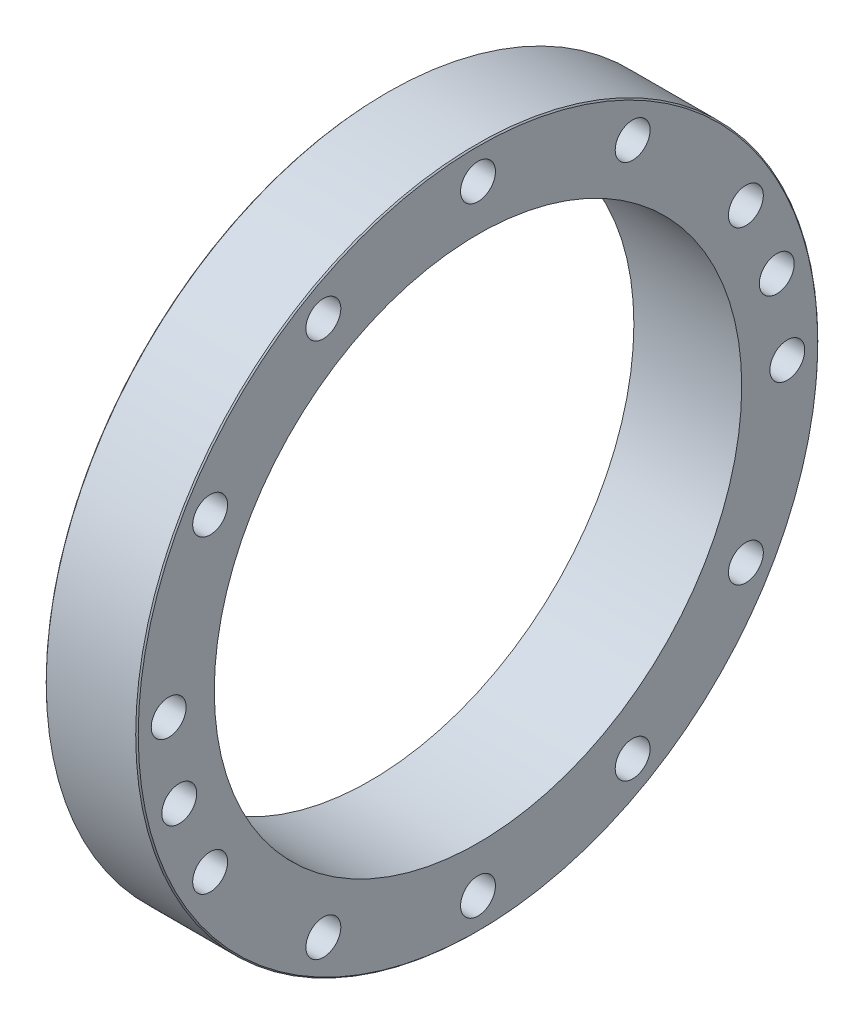
ISO-10303-21;
HEADER;
FILE_DESCRIPTION(('STEP AP214'),'2;1');
FILE_NAME('part.step','',(''),(''),'','','');
FILE_SCHEMA(('AUTOMOTIVE_DESIGN { 1 0 10303 214 1 1 1 1 }'));
ENDSEC;
DATA;
#1=APPLICATION_CONTEXT('core data for automotive mechanical design processes');
#2=APPLICATION_PROTOCOL_DEFINITION('international standard','automotive_design',2000,#1);
#3=PRODUCT_CONTEXT('',#1,'mechanical');
#4=PRODUCT('Part','Part','',(#3));
#5=PRODUCT_RELATED_PRODUCT_CATEGORY('part','',(#4));
#6=PRODUCT_DEFINITION_FORMATION('','',#4);
#7=PRODUCT_DEFINITION_CONTEXT('part definition',#1,'design');
#8=PRODUCT_DEFINITION('design','',#6,#7);
#9=PRODUCT_DEFINITION_SHAPE('','',#8);
#10=(LENGTH_UNIT() NAMED_UNIT(*) SI_UNIT(.MILLI.,.METRE.));
#11=(NAMED_UNIT(*) PLANE_ANGLE_UNIT() SI_UNIT($,.RADIAN.));
#12=(NAMED_UNIT(*) SI_UNIT($,.STERADIAN.) SOLID_ANGLE_UNIT());
#13=UNCERTAINTY_MEASURE_WITH_UNIT(LENGTH_MEASURE(1.E-05),#10,'distance_accuracy_value','');
#14=(GEOMETRIC_REPRESENTATION_CONTEXT(3) GLOBAL_UNCERTAINTY_ASSIGNED_CONTEXT((#13)) GLOBAL_UNIT_ASSIGNED_CONTEXT((#10,
#11,#12)) REPRESENTATION_CONTEXT('',''));
#15=CARTESIAN_POINT('',(0.,0.,0.));
#16=DIRECTION('',(0.,0.,1.));
#17=DIRECTION('',(1.,0.,0.));
#18=AXIS2_PLACEMENT_3D('',#15,#16,#17);
#19=CARTESIAN_POINT('',(60.,-25.2348568974958,94.1777680631842));
#20=DIRECTION('',(-1.,0.,0.));
#21=DIRECTION('',(0.,0.,1.));
#22=AXIS2_PLACEMENT_3D('',#19,#20,#21);
#23=CYLINDRICAL_SURFACE('',#22,4.25);
#24=CARTESIAN_POINT('',(66.7500000000132,-25.2348568974958,94.1777680631842));
#25=DIRECTION('',(1.,0.,0.));
#26=DIRECTION('',(0.,0.25881904509857,-0.965925826290127));
#27=AXIS2_PLACEMENT_3D('',#24,#25,#26);
#28=CIRCLE('',#27,4.24999999995803);
#29=CARTESIAN_POINT('',(66.7500000000132,-24.1348759558377,90.0725833014917));
#30=VERTEX_POINT('',#29);
#31=EDGE_CURVE('E30',#30,#30,#28,.T.);
#32=ORIENTED_EDGE('',*,*,#31,.T.);
#33=EDGE_LOOP('',(#32));
#34=FACE_BOUND('',#33,.T.);
#35=CARTESIAN_POINT('',(53.2499999998777,-25.2348568974958,94.1777680631842));
#36=DIRECTION('',(-1.,0.,0.));
#37=DIRECTION('',(0.,0.258819045104809,-0.965925826288455));
#38=AXIS2_PLACEMENT_3D('',#35,#36,#37);
#39=CIRCLE('',#38,4.24999999996539);
#40=CARTESIAN_POINT('',(53.2499999998777,-24.1348759558093,90.0725833014917));
#41=VERTEX_POINT('',#40);
#42=EDGE_CURVE('E149',#41,#41,#39,.T.);
#43=ORIENTED_EDGE('',*,*,#42,.T.);
#44=EDGE_LOOP('',(#43));
#45=FACE_BOUND('',#44,.T.);
#46=ADVANCED_FACE('F15',(#34,#45),#23,.F.);
#47=CARTESIAN_POINT('',(60.,25.2348568974958,-94.1777680631842));
#48=DIRECTION('',(-1.,0.,0.));
#49=DIRECTION('',(0.,0.,1.));
#50=AXIS2_PLACEMENT_3D('',#47,#48,#49);
#51=CYLINDRICAL_SURFACE('',#50,4.25);
#52=CARTESIAN_POINT('',(66.7500000000132,25.2348568974958,-94.1777680631842));
#53=DIRECTION('',(1.,0.,0.));
#54=DIRECTION('',(0.,-0.25881904509857,0.965925826290127));
#55=AXIS2_PLACEMENT_3D('',#52,#53,#54);
#56=CIRCLE('',#55,4.24999999995803);
#57=CARTESIAN_POINT('',(66.7500000000132,24.1348759558377,-90.0725833014917));
#58=VERTEX_POINT('',#57);
#59=EDGE_CURVE('E155',#58,#58,#56,.T.);
#60=ORIENTED_EDGE('',*,*,#59,.T.);
#61=EDGE_LOOP('',(#60));
#62=FACE_BOUND('',#61,.T.);
#63=CARTESIAN_POINT('',(53.2499999998777,25.2348568974958,-94.1777680631842));
#64=DIRECTION('',(-1.,0.,0.));
#65=DIRECTION('',(0.,-0.258819045104809,0.965925826288455));
#66=AXIS2_PLACEMENT_3D('',#63,#64,#65);
#67=CIRCLE('',#66,4.24999999996539);
#68=CARTESIAN_POINT('',(53.2499999998777,24.1348759558093,-90.0725833014917));
#69=VERTEX_POINT('',#68);
#70=EDGE_CURVE('E144',#69,#69,#67,.T.);
#71=ORIENTED_EDGE('',*,*,#70,.T.);
#72=EDGE_LOOP('',(#71));
#73=FACE_BOUND('',#72,.T.);
#74=ADVANCED_FACE('F167',(#62,#73),#51,.F.);
#75=CARTESIAN_POINT('',(67.4999999999386,-25.2348568974958,94.1777680631842));
#76=DIRECTION('',(1.,0.,0.));
#77=DIRECTION('',(0.,0.,-1.));
#78=AXIS2_PLACEMENT_3D('',#75,#76,#77);
#79=CONICAL_SURFACE('',#78,4.99999999985495,0.785398163375869);
#80=CARTESIAN_POINT('',(67.4999999999955,-25.2348568974958,94.1777680631842));
#81=DIRECTION('',(1.,0.,0.));
#82=DIRECTION('',(0.,0.,-1.));
#83=AXIS2_PLACEMENT_3D('',#80,#81,#82);
#84=CIRCLE('',#83,4.9999999999118);
#85=CARTESIAN_POINT('',(67.4999999999955,-25.2348568974958,89.1777680632724));
#86=VERTEX_POINT('',#85);
#87=EDGE_CURVE('E18',#86,#86,#84,.T.);
#88=ORIENTED_EDGE('',*,*,#87,.T.);
#89=EDGE_LOOP('',(#88));
#90=FACE_BOUND('',#89,.T.);
#91=ORIENTED_EDGE('',*,*,#31,.F.);
#92=EDGE_LOOP('',(#91));
#93=FACE_BOUND('',#92,.T.);
#94=ADVANCED_FACE('F164',(#90,#93),#79,.F.);
#95=CARTESIAN_POINT('',(67.4999999999386,25.2348568974958,-94.1777680631842));
#96=DIRECTION('',(1.,0.,0.));
#97=DIRECTION('',(0.,0.,-1.));
#98=AXIS2_PLACEMENT_3D('',#95,#96,#97);
#99=CONICAL_SURFACE('',#98,4.99999999985495,0.785398163375869);
#100=CARTESIAN_POINT('',(67.4999999999955,25.2348568974958,-94.1777680631842));
#101=DIRECTION('',(1.,0.,0.));
#102=DIRECTION('',(0.,0.,-1.));
#103=AXIS2_PLACEMENT_3D('',#100,#101,#102);
#104=CIRCLE('',#103,4.9999999999118);
#105=CARTESIAN_POINT('',(67.4999999999955,25.2348568974958,-99.177768063096));
#106=VERTEX_POINT('',#105);
#107=EDGE_CURVE('E135',#106,#106,#104,.T.);
#108=ORIENTED_EDGE('',*,*,#107,.T.);
#109=EDGE_LOOP('',(#108));
#110=FACE_BOUND('',#109,.T.);
#111=ORIENTED_EDGE('',*,*,#59,.F.);
#112=EDGE_LOOP('',(#111));
#113=FACE_BOUND('',#112,.T.);
#114=ADVANCED_FACE('F166',(#110,#113),#99,.F.);
#115=CARTESIAN_POINT('',(52.5000000000659,-25.2348568974958,94.1777680631842));
#116=DIRECTION('',(-1.,0.,0.));
#117=DIRECTION('',(0.,-1.,0.));
#118=AXIS2_PLACEMENT_3D('',#115,#116,#117);
#119=CONICAL_SURFACE('',#118,4.9999999998476,0.785398163410152);
#120=ORIENTED_EDGE('',*,*,#42,.F.);
#121=EDGE_LOOP('',(#120));
#122=FACE_BOUND('',#121,.T.);
#123=CARTESIAN_POINT('',(52.5000000000248,-25.2348568974958,94.1777680631842));
#124=DIRECTION('',(-1.,0.,0.));
#125=DIRECTION('',(0.,-1.,0.));
#126=AXIS2_PLACEMENT_3D('',#123,#124,#125);
#127=CIRCLE('',#126,4.9999999998887);
#128=CARTESIAN_POINT('',(52.5000000000248,-30.2348568973845,94.1777680631842));
#129=VERTEX_POINT('',#128);
#130=EDGE_CURVE('E133',#129,#129,#127,.F.);
#131=ORIENTED_EDGE('',*,*,#130,.F.);
#132=EDGE_LOOP('',(#131));
#133=FACE_BOUND('',#132,.T.);
#134=ADVANCED_FACE('F174',(#122,#133),#119,.F.);
#135=CARTESIAN_POINT('',(52.5000000000659,25.2348568974958,-94.1777680631842));
#136=DIRECTION('',(-1.,0.,0.));
#137=DIRECTION('',(0.,-1.,0.));
#138=AXIS2_PLACEMENT_3D('',#135,#136,#137);
#139=CONICAL_SURFACE('',#138,4.9999999998476,0.785398163410152);
#140=ORIENTED_EDGE('',*,*,#70,.F.);
#141=EDGE_LOOP('',(#140));
#142=FACE_BOUND('',#141,.T.);
#143=CARTESIAN_POINT('',(52.5000000000248,25.2348568974958,-94.1777680631842));
#144=DIRECTION('',(-1.,0.,0.));
#145=DIRECTION('',(0.,-1.,0.));
#146=AXIS2_PLACEMENT_3D('',#143,#144,#145);
#147=CIRCLE('',#146,4.9999999998887);
#148=CARTESIAN_POINT('',(52.5000000000248,20.2348568976071,-94.1777680631842));
#149=VERTEX_POINT('',#148);
#150=EDGE_CURVE('E130',#149,#149,#147,.F.);
#151=ORIENTED_EDGE('',*,*,#150,.F.);
#152=EDGE_LOOP('',(#151));
#153=FACE_BOUND('',#152,.T.);
#154=ADVANCED_FACE('F277',(#142,#153),#139,.F.);
#155=CARTESIAN_POINT('',(50.4,0.,0.));
#156=DIRECTION('',(-1.,0.,0.));
#157=DIRECTION('',(0.,0.,1.));
#158=AXIS2_PLACEMENT_3D('',#155,#156,#157);
#159=CYLINDRICAL_SURFACE('',#158,88.5);
#160=CARTESIAN_POINT('',(52.5,0.,0.));
#161=DIRECTION('',(-1.,0.,0.));
#162=DIRECTION('',(0.,0.,1.));
#163=AXIS2_PLACEMENT_3D('',#160,#161,#162);
#164=CIRCLE('',#163,88.5);
#165=CARTESIAN_POINT('',(52.5,0.,88.5));
#166=VERTEX_POINT('',#165);
#167=EDGE_CURVE('E124',#166,#166,#164,.F.);
#168=ORIENTED_EDGE('',*,*,#167,.F.);
#169=EDGE_LOOP('',(#168));
#170=FACE_BOUND('',#169,.T.);
#171=CARTESIAN_POINT('',(48.3,0.,0.));
#172=DIRECTION('',(1.,0.,0.));
#173=DIRECTION('',(0.,0.,1.));
#174=AXIS2_PLACEMENT_3D('',#171,#172,#173);
#175=CIRCLE('',#174,88.5);
#176=CARTESIAN_POINT('',(48.3,0.,88.5));
#177=VERTEX_POINT('',#176);
#178=EDGE_CURVE('E140',#177,#177,#175,.F.);
#179=ORIENTED_EDGE('',*,*,#178,.F.);
#180=EDGE_LOOP('',(#179));
#181=FACE_BOUND('',#180,.T.);
#182=ADVANCED_FACE('F274',(#170,#181),#159,.T.);
#183=CARTESIAN_POINT('',(48.3,0.,0.));
#184=DIRECTION('',(1.,0.,0.));
#185=DIRECTION('',(0.,1.,0.));
#186=AXIS2_PLACEMENT_3D('',#183,#184,#185);
#187=CONICAL_SURFACE('',#186,88.5,0.785398163397448);
#188=ORIENTED_EDGE('',*,*,#178,.T.);
#189=EDGE_LOOP('',(#188));
#190=FACE_BOUND('',#189,.T.);
#191=CARTESIAN_POINT('',(47.5,0.,0.));
#192=DIRECTION('',(1.,0.,0.));
#193=DIRECTION('',(0.,1.,0.));
#194=AXIS2_PLACEMENT_3D('',#191,#192,#193);
#195=CIRCLE('',#194,87.7);
#196=CARTESIAN_POINT('',(47.5,87.7,0.));
#197=VERTEX_POINT('',#196);
#198=EDGE_CURVE('E121',#197,#197,#195,.F.);
#199=ORIENTED_EDGE('',*,*,#198,.F.);
#200=EDGE_LOOP('',(#199));
#201=FACE_BOUND('',#200,.T.);
#202=ADVANCED_FACE('F270',(#190,#201),#187,.T.);
#203=CARTESIAN_POINT('',(52.9,0.,0.));
#204=DIRECTION('',(1.,0.,0.));
#205=DIRECTION('',(0.,1.,0.));
#206=AXIS2_PLACEMENT_3D('',#203,#204,#205);
#207=CONICAL_SURFACE('',#206,107.5,0.785398163397448);
#208=CARTESIAN_POINT('',(52.9,0.,0.));
#209=DIRECTION('',(-1.,0.,0.));
#210=DIRECTION('',(0.,0.,1.));
#211=AXIS2_PLACEMENT_3D('',#208,#209,#210);
#212=CIRCLE('',#211,107.5);
#213=CARTESIAN_POINT('',(52.9,0.,107.5));
#214=VERTEX_POINT('',#213);
#215=EDGE_CURVE('E120',#214,#214,#212,.F.);
#216=ORIENTED_EDGE('',*,*,#215,.F.);
#217=EDGE_LOOP('',(#216));
#218=FACE_BOUND('',#217,.T.);
#219=CARTESIAN_POINT('',(52.5,0.,0.));
#220=DIRECTION('',(1.,0.,0.));
#221=DIRECTION('',(0.,1.,0.));
#222=AXIS2_PLACEMENT_3D('',#219,#220,#221);
#223=CIRCLE('',#222,107.1);
#224=CARTESIAN_POINT('',(52.5,107.1,0.));
#225=VERTEX_POINT('',#224);
#226=EDGE_CURVE('E127',#225,#225,#223,.F.);
#227=ORIENTED_EDGE('',*,*,#226,.F.);
#228=EDGE_LOOP('',(#227));
#229=FACE_BOUND('',#228,.T.);
#230=ADVANCED_FACE('F266',(#218,#229),#207,.T.);
#231=CARTESIAN_POINT('',(67.5,-25.9466092715277,96.8340640854791));
#232=DIRECTION('',(-1.,0.,0.));
#233=DIRECTION('',(0.,0.,1.));
#234=AXIS2_PLACEMENT_3D('',#231,#232,#233);
#235=PLANE('',#234);
#236=CARTESIAN_POINT('',(67.5,-25.2348568974958,94.1777680631842));
#237=DIRECTION('',(-1.,0.,0.));
#238=DIRECTION('',(0.,0.,1.));
#239=AXIS2_PLACEMENT_3D('',#236,#237,#238);
#240=CIRCLE('',#239,5.5);
#241=CARTESIAN_POINT('',(67.5,-25.2348568974958,99.6777680631842));
#242=VERTEX_POINT('',#241);
#243=EDGE_CURVE('E117',#242,#242,#240,.F.);
#244=ORIENTED_EDGE('',*,*,#243,.T.);
#245=EDGE_LOOP('',(#244));
#246=FACE_BOUND('',#245,.T.);
#247=ORIENTED_EDGE('',*,*,#87,.F.);
#248=EDGE_LOOP('',(#247));
#249=FACE_BOUND('',#248,.T.);
#250=ADVANCED_FACE('F262',(#246,#249),#235,.F.);
#251=CARTESIAN_POINT('',(67.5,25.9466092715277,-96.8340640854791));
#252=DIRECTION('',(-1.,0.,0.));
#253=DIRECTION('',(0.,0.,1.));
#254=AXIS2_PLACEMENT_3D('',#251,#252,#253);
#255=PLANE('',#254);
#256=CARTESIAN_POINT('',(67.5,25.2348568974958,-94.1777680631842));
#257=DIRECTION('',(-1.,0.,0.));
#258=DIRECTION('',(0.,0.,1.));
#259=AXIS2_PLACEMENT_3D('',#256,#257,#258);
#260=CIRCLE('',#259,5.5);
#261=CARTESIAN_POINT('',(67.5,25.2348568974958,-88.6777680631842));
#262=VERTEX_POINT('',#261);
#263=EDGE_CURVE('E114',#262,#262,#260,.F.);
#264=ORIENTED_EDGE('',*,*,#263,.T.);
#265=EDGE_LOOP('',(#264));
#266=FACE_BOUND('',#265,.T.);
#267=ORIENTED_EDGE('',*,*,#107,.F.);
#268=EDGE_LOOP('',(#267));
#269=FACE_BOUND('',#268,.T.);
#270=ADVANCED_FACE('F258',(#266,#269),#255,.F.);
#271=CARTESIAN_POINT('',(52.5,0.,97.8));
#272=DIRECTION('',(-1.,0.,0.));
#273=DIRECTION('',(0.,0.,1.));
#274=AXIS2_PLACEMENT_3D('',#271,#272,#273);
#275=PLANE('',#274);
#276=ORIENTED_EDGE('',*,*,#167,.T.);
#277=EDGE_LOOP('',(#276));
#278=FACE_BOUND('',#277,.T.);
#279=ORIENTED_EDGE('',*,*,#226,.T.);
#280=EDGE_LOOP('',(#279));
#281=FACE_BOUND('',#280,.T.);
#282=CARTESIAN_POINT('',(52.5,0.,-97.5));
#283=DIRECTION('',(-1.,0.,0.));
#284=DIRECTION('',(0.,0.,1.));
#285=AXIS2_PLACEMENT_3D('',#282,#283,#284);
#286=CIRCLE('',#285,5.5);
#287=CARTESIAN_POINT('',(52.5,0.,-92.));
#288=VERTEX_POINT('',#287);
#289=EDGE_CURVE('E78',#288,#288,#286,.F.);
#290=ORIENTED_EDGE('',*,*,#289,.T.);
#291=EDGE_LOOP('',(#290));
#292=FACE_BOUND('',#291,.T.);
#293=CARTESIAN_POINT('',(52.5,48.75,-84.4374768689828));
#294=DIRECTION('',(-1.,0.,0.));
#295=DIRECTION('',(0.,0.,1.));
#296=AXIS2_PLACEMENT_3D('',#293,#294,#295);
#297=CIRCLE('',#296,5.5);
#298=CARTESIAN_POINT('',(52.5,48.75,-78.9374768689828));
#299=VERTEX_POINT('',#298);
#300=EDGE_CURVE('E81',#299,#299,#297,.F.);
#301=ORIENTED_EDGE('',*,*,#300,.T.);
#302=EDGE_LOOP('',(#301));
#303=FACE_BOUND('',#302,.T.);
#304=CARTESIAN_POINT('',(52.5,84.4374768689828,-48.75));
#305=DIRECTION('',(-1.,0.,0.));
#306=DIRECTION('',(0.,0.,1.));
#307=AXIS2_PLACEMENT_3D('',#304,#305,#306);
#308=CIRCLE('',#307,5.5);
#309=CARTESIAN_POINT('',(52.5,84.4374768689828,-43.25));
#310=VERTEX_POINT('',#309);
#311=EDGE_CURVE('E84',#310,#310,#308,.F.);
#312=ORIENTED_EDGE('',*,*,#311,.T.);
#313=EDGE_LOOP('',(#312));
#314=FACE_BOUND('',#313,.T.);
#315=CARTESIAN_POINT('',(52.5,97.5,0.));
#316=DIRECTION('',(-1.,0.,0.));
#317=DIRECTION('',(0.,0.,1.));
#318=AXIS2_PLACEMENT_3D('',#315,#316,#317);
#319=CIRCLE('',#318,5.5);
#320=CARTESIAN_POINT('',(52.5,97.5,5.5));
#321=VERTEX_POINT('',#320);
#322=EDGE_CURVE('E87',#321,#321,#319,.F.);
#323=ORIENTED_EDGE('',*,*,#322,.T.);
#324=EDGE_LOOP('',(#323));
#325=FACE_BOUND('',#324,.T.);
#326=CARTESIAN_POINT('',(52.5,84.4374768689828,48.75));
#327=DIRECTION('',(-1.,0.,0.));
#328=DIRECTION('',(0.,0.,1.));
#329=AXIS2_PLACEMENT_3D('',#326,#327,#328);
#330=CIRCLE('',#329,5.5);
#331=CARTESIAN_POINT('',(52.5,84.4374768689828,54.25));
#332=VERTEX_POINT('',#331);
#333=EDGE_CURVE('E90',#332,#332,#330,.F.);
#334=ORIENTED_EDGE('',*,*,#333,.T.);
#335=EDGE_LOOP('',(#334));
#336=FACE_BOUND('',#335,.T.);
#337=CARTESIAN_POINT('',(52.5,48.75,84.4374768689828));
#338=DIRECTION('',(-1.,0.,0.));
#339=DIRECTION('',(0.,0.,1.));
#340=AXIS2_PLACEMENT_3D('',#337,#338,#339);
#341=CIRCLE('',#340,5.5);
#342=CARTESIAN_POINT('',(52.5,48.75,89.9374768689828));
#343=VERTEX_POINT('',#342);
#344=EDGE_CURVE('E93',#343,#343,#341,.F.);
#345=ORIENTED_EDGE('',*,*,#344,.T.);
#346=EDGE_LOOP('',(#345));
#347=FACE_BOUND('',#346,.T.);
#348=CARTESIAN_POINT('',(52.5,0.,97.5));
#349=DIRECTION('',(-1.,0.,0.));
#350=DIRECTION('',(0.,0.,1.));
#351=AXIS2_PLACEMENT_3D('',#348,#349,#350);
#352=CIRCLE('',#351,5.5);
#353=CARTESIAN_POINT('',(52.5,0.,103.));
#354=VERTEX_POINT('',#353);
#355=EDGE_CURVE('E96',#354,#354,#352,.F.);
#356=ORIENTED_EDGE('',*,*,#355,.T.);
#357=EDGE_LOOP('',(#356));
#358=FACE_BOUND('',#357,.T.);
#359=CARTESIAN_POINT('',(52.5,-48.75,84.4374768689828));
#360=DIRECTION('',(-1.,0.,0.));
#361=DIRECTION('',(0.,0.,1.));
#362=AXIS2_PLACEMENT_3D('',#359,#360,#361);
#363=CIRCLE('',#362,5.5);
#364=CARTESIAN_POINT('',(52.5,-48.75,89.9374768689828));
#365=VERTEX_POINT('',#364);
#366=EDGE_CURVE('E99',#365,#365,#363,.F.);
#367=ORIENTED_EDGE('',*,*,#366,.T.);
#368=EDGE_LOOP('',(#367));
#369=FACE_BOUND('',#368,.T.);
#370=CARTESIAN_POINT('',(52.5,-84.4374768689827,48.75));
#371=DIRECTION('',(-1.,0.,0.));
#372=DIRECTION('',(0.,0.,1.));
#373=AXIS2_PLACEMENT_3D('',#370,#371,#372);
#374=CIRCLE('',#373,5.5);
#375=CARTESIAN_POINT('',(52.5,-84.4374768689827,54.25));
#376=VERTEX_POINT('',#375);
#377=EDGE_CURVE('E102',#376,#376,#374,.F.);
#378=ORIENTED_EDGE('',*,*,#377,.T.);
#379=EDGE_LOOP('',(#378));
#380=FACE_BOUND('',#379,.T.);
#381=CARTESIAN_POINT('',(52.5,-97.5,0.));
#382=DIRECTION('',(-1.,0.,0.));
#383=DIRECTION('',(0.,0.,1.));
#384=AXIS2_PLACEMENT_3D('',#381,#382,#383);
#385=CIRCLE('',#384,5.5);
#386=CARTESIAN_POINT('',(52.5,-97.5,5.5));
#387=VERTEX_POINT('',#386);
#388=EDGE_CURVE('E105',#387,#387,#385,.F.);
#389=ORIENTED_EDGE('',*,*,#388,.T.);
#390=EDGE_LOOP('',(#389));
#391=FACE_BOUND('',#390,.T.);
#392=CARTESIAN_POINT('',(52.5,-84.4374768689828,-48.75));
#393=DIRECTION('',(-1.,0.,0.));
#394=DIRECTION('',(0.,0.,1.));
#395=AXIS2_PLACEMENT_3D('',#392,#393,#394);
#396=CIRCLE('',#395,5.5);
#397=CARTESIAN_POINT('',(52.5,-84.4374768689828,-43.25));
#398=VERTEX_POINT('',#397);
#399=EDGE_CURVE('E108',#398,#398,#396,.F.);
#400=ORIENTED_EDGE('',*,*,#399,.T.);
#401=EDGE_LOOP('',(#400));
#402=FACE_BOUND('',#401,.T.);
#403=CARTESIAN_POINT('',(52.5,-48.75,-84.4374768689827));
#404=DIRECTION('',(-1.,0.,0.));
#405=DIRECTION('',(0.,0.,1.));
#406=AXIS2_PLACEMENT_3D('',#403,#404,#405);
#407=CIRCLE('',#406,5.5);
#408=CARTESIAN_POINT('',(52.5,-48.75,-78.9374768689827));
#409=VERTEX_POINT('',#408);
#410=EDGE_CURVE('E111',#409,#409,#407,.F.);
#411=ORIENTED_EDGE('',*,*,#410,.T.);
#412=EDGE_LOOP('',(#411));
#413=FACE_BOUND('',#412,.T.);
#414=ORIENTED_EDGE('',*,*,#150,.T.);
#415=EDGE_LOOP('',(#414));
#416=FACE_BOUND('',#415,.T.);
#417=ORIENTED_EDGE('',*,*,#130,.T.);
#418=EDGE_LOOP('',(#417));
#419=FACE_BOUND('',#418,.T.);
#420=ADVANCED_FACE('F254',(#278,#281,#292,#303,#314,#325,#336,#347,#358,#369,#380,#391,#402,
#413,#416,#419),#275,.T.);
#421=CARTESIAN_POINT('',(47.5,0.,85.4165));
#422=DIRECTION('',(-1.,0.,0.));
#423=DIRECTION('',(0.,0.,1.));
#424=AXIS2_PLACEMENT_3D('',#421,#422,#423);
#425=PLANE('',#424);
#426=CARTESIAN_POINT('',(47.5,0.,0.));
#427=DIRECTION('',(-1.,0.,0.));
#428=DIRECTION('',(0.,0.,1.));
#429=AXIS2_PLACEMENT_3D('',#426,#427,#428);
#430=CIRCLE('',#429,83.133);
#431=CARTESIAN_POINT('',(47.5,0.,83.133));
#432=VERTEX_POINT('',#431);
#433=EDGE_CURVE('E75',#432,#432,#430,.F.);
#434=ORIENTED_EDGE('',*,*,#433,.T.);
#435=EDGE_LOOP('',(#434));
#436=FACE_BOUND('',#435,.T.);
#437=ORIENTED_EDGE('',*,*,#198,.T.);
#438=EDGE_LOOP('',(#437));
#439=FACE_BOUND('',#438,.T.);
#440=ADVANCED_FACE('F250',(#436,#439),#425,.T.);
#441=CARTESIAN_POINT('',(67.,0.,0.));
#442=DIRECTION('',(-1.,0.,0.));
#443=DIRECTION('',(0.,0.,1.));
#444=AXIS2_PLACEMENT_3D('',#441,#442,#443);
#445=CYLINDRICAL_SURFACE('',#444,107.5);
#446=CARTESIAN_POINT('',(81.1,0.,0.));
#447=DIRECTION('',(-1.,0.,0.));
#448=DIRECTION('',(0.,0.,1.));
#449=AXIS2_PLACEMENT_3D('',#446,#447,#448);
#450=CIRCLE('',#449,107.5);
#451=CARTESIAN_POINT('',(81.1,0.,107.5));
#452=VERTEX_POINT('',#451);
#453=EDGE_CURVE('E74',#452,#452,#450,.F.);
#454=ORIENTED_EDGE('',*,*,#453,.F.);
#455=EDGE_LOOP('',(#454));
#456=FACE_BOUND('',#455,.T.);
#457=ORIENTED_EDGE('',*,*,#215,.T.);
#458=EDGE_LOOP('',(#457));
#459=FACE_BOUND('',#458,.T.);
#460=ADVANCED_FACE('F246',(#456,#459),#445,.T.);
#461=CARTESIAN_POINT('',(74.5,-25.2348568974958,94.1777680631842));
#462=DIRECTION('',(-1.,0.,0.));
#463=DIRECTION('',(0.,0.,1.));
#464=AXIS2_PLACEMENT_3D('',#461,#462,#463);
#465=CYLINDRICAL_SURFACE('',#464,5.5);
#466=CARTESIAN_POINT('',(81.5,-25.2348568974958,94.1777680631842));
#467=DIRECTION('',(-1.,0.,0.));
#468=DIRECTION('',(0.,0.,1.));
#469=AXIS2_PLACEMENT_3D('',#466,#467,#468);
#470=CIRCLE('',#469,5.5);
#471=CARTESIAN_POINT('',(81.5,-25.2348568974958,99.6777680631842));
#472=VERTEX_POINT('',#471);
#473=EDGE_CURVE('E71',#472,#472,#470,.T.);
#474=ORIENTED_EDGE('',*,*,#473,.F.);
#475=EDGE_LOOP('',(#474));
#476=FACE_BOUND('',#475,.T.);
#477=ORIENTED_EDGE('',*,*,#243,.F.);
#478=EDGE_LOOP('',(#477));
#479=FACE_BOUND('',#478,.T.);
#480=ADVANCED_FACE('F242',(#476,#479),#465,.F.);
#481=CARTESIAN_POINT('',(74.5,25.2348568974958,-94.1777680631842));
#482=DIRECTION('',(-1.,0.,0.));
#483=DIRECTION('',(0.,0.,1.));
#484=AXIS2_PLACEMENT_3D('',#481,#482,#483);
#485=CYLINDRICAL_SURFACE('',#484,5.5);
#486=CARTESIAN_POINT('',(81.5,25.2348568974958,-94.1777680631842));
#487=DIRECTION('',(-1.,0.,0.));
#488=DIRECTION('',(0.,0.,1.));
#489=AXIS2_PLACEMENT_3D('',#486,#487,#488);
#490=CIRCLE('',#489,5.5);
#491=CARTESIAN_POINT('',(81.5,25.2348568974958,-88.6777680631842));
#492=VERTEX_POINT('',#491);
#493=EDGE_CURVE('E68',#492,#492,#490,.T.);
#494=ORIENTED_EDGE('',*,*,#493,.F.);
#495=EDGE_LOOP('',(#494));
#496=FACE_BOUND('',#495,.T.);
#497=ORIENTED_EDGE('',*,*,#263,.F.);
#498=EDGE_LOOP('',(#497));
#499=FACE_BOUND('',#498,.T.);
#500=ADVANCED_FACE('F238',(#496,#499),#485,.F.);
#501=CARTESIAN_POINT('',(67.,-48.75,-84.4374768689827));
#502=DIRECTION('',(-1.,0.,0.));
#503=DIRECTION('',(0.,0.,1.));
#504=AXIS2_PLACEMENT_3D('',#501,#502,#503);
#505=CYLINDRICAL_SURFACE('',#504,5.5);
#506=CARTESIAN_POINT('',(81.5,-48.75,-84.4374768689827));
#507=DIRECTION('',(-1.,0.,0.));
#508=DIRECTION('',(0.,0.,1.));
#509=AXIS2_PLACEMENT_3D('',#506,#507,#508);
#510=CIRCLE('',#509,5.5);
#511=CARTESIAN_POINT('',(81.5,-48.75,-78.9374768689827));
#512=VERTEX_POINT('',#511);
#513=EDGE_CURVE('E65',#512,#512,#510,.T.);
#514=ORIENTED_EDGE('',*,*,#513,.F.);
#515=EDGE_LOOP('',(#514));
#516=FACE_BOUND('',#515,.T.);
#517=ORIENTED_EDGE('',*,*,#410,.F.);
#518=EDGE_LOOP('',(#517));
#519=FACE_BOUND('',#518,.T.);
#520=ADVANCED_FACE('F234',(#516,#519),#505,.F.);
#521=CARTESIAN_POINT('',(67.,-84.4374768689828,-48.75));
#522=DIRECTION('',(-1.,0.,0.));
#523=DIRECTION('',(0.,0.,1.));
#524=AXIS2_PLACEMENT_3D('',#521,#522,#523);
#525=CYLINDRICAL_SURFACE('',#524,5.5);
#526=CARTESIAN_POINT('',(81.5,-84.4374768689828,-48.75));
#527=DIRECTION('',(-1.,0.,0.));
#528=DIRECTION('',(0.,0.,1.));
#529=AXIS2_PLACEMENT_3D('',#526,#527,#528);
#530=CIRCLE('',#529,5.5);
#531=CARTESIAN_POINT('',(81.5,-84.4374768689828,-43.25));
#532=VERTEX_POINT('',#531);
#533=EDGE_CURVE('E62',#532,#532,#530,.T.);
#534=ORIENTED_EDGE('',*,*,#533,.F.);
#535=EDGE_LOOP('',(#534));
#536=FACE_BOUND('',#535,.T.);
#537=ORIENTED_EDGE('',*,*,#399,.F.);
#538=EDGE_LOOP('',(#537));
#539=FACE_BOUND('',#538,.T.);
#540=ADVANCED_FACE('F230',(#536,#539),#525,.F.);
#541=CARTESIAN_POINT('',(67.,-97.5,0.));
#542=DIRECTION('',(-1.,0.,0.));
#543=DIRECTION('',(0.,0.,1.));
#544=AXIS2_PLACEMENT_3D('',#541,#542,#543);
#545=CYLINDRICAL_SURFACE('',#544,5.5);
#546=CARTESIAN_POINT('',(81.5,-97.5,0.));
#547=DIRECTION('',(-1.,0.,0.));
#548=DIRECTION('',(0.,0.,1.));
#549=AXIS2_PLACEMENT_3D('',#546,#547,#548);
#550=CIRCLE('',#549,5.5);
#551=CARTESIAN_POINT('',(81.5,-97.5,5.5));
#552=VERTEX_POINT('',#551);
#553=EDGE_CURVE('E59',#552,#552,#550,.T.);
#554=ORIENTED_EDGE('',*,*,#553,.F.);
#555=EDGE_LOOP('',(#554));
#556=FACE_BOUND('',#555,.T.);
#557=ORIENTED_EDGE('',*,*,#388,.F.);
#558=EDGE_LOOP('',(#557));
#559=FACE_BOUND('',#558,.T.);
#560=ADVANCED_FACE('F226',(#556,#559),#545,.F.);
#561=CARTESIAN_POINT('',(67.,-84.4374768689827,48.75));
#562=DIRECTION('',(-1.,0.,0.));
#563=DIRECTION('',(0.,0.,1.));
#564=AXIS2_PLACEMENT_3D('',#561,#562,#563);
#565=CYLINDRICAL_SURFACE('',#564,5.5);
#566=CARTESIAN_POINT('',(81.5,-84.4374768689827,48.75));
#567=DIRECTION('',(-1.,0.,0.));
#568=DIRECTION('',(0.,0.,1.));
#569=AXIS2_PLACEMENT_3D('',#566,#567,#568);
#570=CIRCLE('',#569,5.5);
#571=CARTESIAN_POINT('',(81.5,-84.4374768689827,54.25));
#572=VERTEX_POINT('',#571);
#573=EDGE_CURVE('E56',#572,#572,#570,.T.);
#574=ORIENTED_EDGE('',*,*,#573,.F.);
#575=EDGE_LOOP('',(#574));
#576=FACE_BOUND('',#575,.T.);
#577=ORIENTED_EDGE('',*,*,#377,.F.);
#578=EDGE_LOOP('',(#577));
#579=FACE_BOUND('',#578,.T.);
#580=ADVANCED_FACE('F222',(#576,#579),#565,.F.);
#581=CARTESIAN_POINT('',(67.,-48.75,84.4374768689828));
#582=DIRECTION('',(-1.,0.,0.));
#583=DIRECTION('',(0.,0.,1.));
#584=AXIS2_PLACEMENT_3D('',#581,#582,#583);
#585=CYLINDRICAL_SURFACE('',#584,5.5);
#586=CARTESIAN_POINT('',(81.5,-48.75,84.4374768689828));
#587=DIRECTION('',(-1.,0.,0.));
#588=DIRECTION('',(0.,0.,1.));
#589=AXIS2_PLACEMENT_3D('',#586,#587,#588);
#590=CIRCLE('',#589,5.5);
#591=CARTESIAN_POINT('',(81.5,-48.75,89.9374768689828));
#592=VERTEX_POINT('',#591);
#593=EDGE_CURVE('E53',#592,#592,#590,.T.);
#594=ORIENTED_EDGE('',*,*,#593,.F.);
#595=EDGE_LOOP('',(#594));
#596=FACE_BOUND('',#595,.T.);
#597=ORIENTED_EDGE('',*,*,#366,.F.);
#598=EDGE_LOOP('',(#597));
#599=FACE_BOUND('',#598,.T.);
#600=ADVANCED_FACE('F218',(#596,#599),#585,.F.);
#601=CARTESIAN_POINT('',(67.,0.,97.5));
#602=DIRECTION('',(-1.,0.,0.));
#603=DIRECTION('',(0.,0.,1.));
#604=AXIS2_PLACEMENT_3D('',#601,#602,#603);
#605=CYLINDRICAL_SURFACE('',#604,5.5);
#606=CARTESIAN_POINT('',(81.5,0.,97.5));
#607=DIRECTION('',(-1.,0.,0.));
#608=DIRECTION('',(0.,0.,1.));
#609=AXIS2_PLACEMENT_3D('',#606,#607,#608);
#610=CIRCLE('',#609,5.5);
#611=CARTESIAN_POINT('',(81.5,0.,103.));
#612=VERTEX_POINT('',#611);
#613=EDGE_CURVE('E50',#612,#612,#610,.T.);
#614=ORIENTED_EDGE('',*,*,#613,.F.);
#615=EDGE_LOOP('',(#614));
#616=FACE_BOUND('',#615,.T.);
#617=ORIENTED_EDGE('',*,*,#355,.F.);
#618=EDGE_LOOP('',(#617));
#619=FACE_BOUND('',#618,.T.);
#620=ADVANCED_FACE('F214',(#616,#619),#605,.F.);
#621=CARTESIAN_POINT('',(67.,48.75,84.4374768689828));
#622=DIRECTION('',(-1.,0.,0.));
#623=DIRECTION('',(0.,0.,1.));
#624=AXIS2_PLACEMENT_3D('',#621,#622,#623);
#625=CYLINDRICAL_SURFACE('',#624,5.5);
#626=CARTESIAN_POINT('',(81.5,48.75,84.4374768689828));
#627=DIRECTION('',(-1.,0.,0.));
#628=DIRECTION('',(0.,0.,1.));
#629=AXIS2_PLACEMENT_3D('',#626,#627,#628);
#630=CIRCLE('',#629,5.5);
#631=CARTESIAN_POINT('',(81.5,48.75,89.9374768689828));
#632=VERTEX_POINT('',#631);
#633=EDGE_CURVE('E47',#632,#632,#630,.T.);
#634=ORIENTED_EDGE('',*,*,#633,.F.);
#635=EDGE_LOOP('',(#634));
#636=FACE_BOUND('',#635,.T.);
#637=ORIENTED_EDGE('',*,*,#344,.F.);
#638=EDGE_LOOP('',(#637));
#639=FACE_BOUND('',#638,.T.);
#640=ADVANCED_FACE('F210',(#636,#639),#625,.F.);
#641=CARTESIAN_POINT('',(67.,84.4374768689828,48.75));
#642=DIRECTION('',(-1.,0.,0.));
#643=DIRECTION('',(0.,0.,1.));
#644=AXIS2_PLACEMENT_3D('',#641,#642,#643);
#645=CYLINDRICAL_SURFACE('',#644,5.5);
#646=CARTESIAN_POINT('',(81.5,84.4374768689828,48.75));
#647=DIRECTION('',(-1.,0.,0.));
#648=DIRECTION('',(0.,0.,1.));
#649=AXIS2_PLACEMENT_3D('',#646,#647,#648);
#650=CIRCLE('',#649,5.5);
#651=CARTESIAN_POINT('',(81.5,84.4374768689828,54.25));
#652=VERTEX_POINT('',#651);
#653=EDGE_CURVE('E44',#652,#652,#650,.T.);
#654=ORIENTED_EDGE('',*,*,#653,.F.);
#655=EDGE_LOOP('',(#654));
#656=FACE_BOUND('',#655,.T.);
#657=ORIENTED_EDGE('',*,*,#333,.F.);
#658=EDGE_LOOP('',(#657));
#659=FACE_BOUND('',#658,.T.);
#660=ADVANCED_FACE('F206',(#656,#659),#645,.F.);
#661=CARTESIAN_POINT('',(67.,97.5,0.));
#662=DIRECTION('',(-1.,0.,0.));
#663=DIRECTION('',(0.,0.,1.));
#664=AXIS2_PLACEMENT_3D('',#661,#662,#663);
#665=CYLINDRICAL_SURFACE('',#664,5.5);
#666=CARTESIAN_POINT('',(81.5,97.5,0.));
#667=DIRECTION('',(-1.,0.,0.));
#668=DIRECTION('',(0.,0.,1.));
#669=AXIS2_PLACEMENT_3D('',#666,#667,#668);
#670=CIRCLE('',#669,5.5);
#671=CARTESIAN_POINT('',(81.5,97.5,5.5));
#672=VERTEX_POINT('',#671);
#673=EDGE_CURVE('E41',#672,#672,#670,.T.);
#674=ORIENTED_EDGE('',*,*,#673,.F.);
#675=EDGE_LOOP('',(#674));
#676=FACE_BOUND('',#675,.T.);
#677=ORIENTED_EDGE('',*,*,#322,.F.);
#678=EDGE_LOOP('',(#677));
#679=FACE_BOUND('',#678,.T.);
#680=ADVANCED_FACE('F202',(#676,#679),#665,.F.);
#681=CARTESIAN_POINT('',(67.,84.4374768689828,-48.75));
#682=DIRECTION('',(-1.,0.,0.));
#683=DIRECTION('',(0.,0.,1.));
#684=AXIS2_PLACEMENT_3D('',#681,#682,#683);
#685=CYLINDRICAL_SURFACE('',#684,5.5);
#686=CARTESIAN_POINT('',(81.5,84.4374768689828,-48.75));
#687=DIRECTION('',(-1.,0.,0.));
#688=DIRECTION('',(0.,0.,1.));
#689=AXIS2_PLACEMENT_3D('',#686,#687,#688);
#690=CIRCLE('',#689,5.5);
#691=CARTESIAN_POINT('',(81.5,84.4374768689828,-43.25));
#692=VERTEX_POINT('',#691);
#693=EDGE_CURVE('E38',#692,#692,#690,.T.);
#694=ORIENTED_EDGE('',*,*,#693,.F.);
#695=EDGE_LOOP('',(#694));
#696=FACE_BOUND('',#695,.T.);
#697=ORIENTED_EDGE('',*,*,#311,.F.);
#698=EDGE_LOOP('',(#697));
#699=FACE_BOUND('',#698,.T.);
#700=ADVANCED_FACE('F198',(#696,#699),#685,.F.);
#701=CARTESIAN_POINT('',(67.,48.75,-84.4374768689828));
#702=DIRECTION('',(-1.,0.,0.));
#703=DIRECTION('',(0.,0.,1.));
#704=AXIS2_PLACEMENT_3D('',#701,#702,#703);
#705=CYLINDRICAL_SURFACE('',#704,5.5);
#706=CARTESIAN_POINT('',(81.5,48.75,-84.4374768689828));
#707=DIRECTION('',(-1.,0.,0.));
#708=DIRECTION('',(0.,0.,1.));
#709=AXIS2_PLACEMENT_3D('',#706,#707,#708);
#710=CIRCLE('',#709,5.5);
#711=CARTESIAN_POINT('',(81.5,48.75,-78.9374768689828));
#712=VERTEX_POINT('',#711);
#713=EDGE_CURVE('E35',#712,#712,#710,.T.);
#714=ORIENTED_EDGE('',*,*,#713,.F.);
#715=EDGE_LOOP('',(#714));
#716=FACE_BOUND('',#715,.T.);
#717=ORIENTED_EDGE('',*,*,#300,.F.);
#718=EDGE_LOOP('',(#717));
#719=FACE_BOUND('',#718,.T.);
#720=ADVANCED_FACE('F194',(#716,#719),#705,.F.);
#721=CARTESIAN_POINT('',(67.,0.,-97.5));
#722=DIRECTION('',(-1.,0.,0.));
#723=DIRECTION('',(0.,0.,1.));
#724=AXIS2_PLACEMENT_3D('',#721,#722,#723);
#725=CYLINDRICAL_SURFACE('',#724,5.5);
#726=CARTESIAN_POINT('',(81.5,0.,-97.5));
#727=DIRECTION('',(-1.,0.,0.));
#728=DIRECTION('',(0.,0.,1.));
#729=AXIS2_PLACEMENT_3D('',#726,#727,#728);
#730=CIRCLE('',#729,5.5);
#731=CARTESIAN_POINT('',(81.5,0.,-92.));
#732=VERTEX_POINT('',#731);
#733=EDGE_CURVE('E27',#732,#732,#730,.T.);
#734=ORIENTED_EDGE('',*,*,#733,.F.);
#735=EDGE_LOOP('',(#734));
#736=FACE_BOUND('',#735,.T.);
#737=ORIENTED_EDGE('',*,*,#289,.F.);
#738=EDGE_LOOP('',(#737));
#739=FACE_BOUND('',#738,.T.);
#740=ADVANCED_FACE('F190',(#736,#739),#725,.F.);
#741=CARTESIAN_POINT('',(64.5,0.,0.));
#742=DIRECTION('',(-1.,0.,0.));
#743=DIRECTION('',(0.,0.,1.));
#744=AXIS2_PLACEMENT_3D('',#741,#742,#743);
#745=CYLINDRICAL_SURFACE('',#744,83.133);
#746=ORIENTED_EDGE('',*,*,#433,.F.);
#747=EDGE_LOOP('',(#746));
#748=FACE_BOUND('',#747,.T.);
#749=CARTESIAN_POINT('',(81.5,0.,0.));
#750=DIRECTION('',(-1.,0.,0.));
#751=DIRECTION('',(0.,0.,1.));
#752=AXIS2_PLACEMENT_3D('',#749,#750,#751);
#753=CIRCLE('',#752,83.133);
#754=CARTESIAN_POINT('',(81.5,0.,83.133));
#755=VERTEX_POINT('',#754);
#756=EDGE_CURVE('E22',#755,#755,#753,.T.);
#757=ORIENTED_EDGE('',*,*,#756,.F.);
#758=EDGE_LOOP('',(#757));
#759=FACE_BOUND('',#758,.T.);
#760=ADVANCED_FACE('F183',(#748,#759),#745,.F.);
#761=CARTESIAN_POINT('',(81.1,0.,0.));
#762=DIRECTION('',(-1.,0.,0.));
#763=DIRECTION('',(0.,0.,1.));
#764=AXIS2_PLACEMENT_3D('',#761,#762,#763);
#765=CONICAL_SURFACE('',#764,107.5,0.785398163397431);
#766=CARTESIAN_POINT('',(81.5,0.,0.));
#767=DIRECTION('',(-1.,0.,0.));
#768=DIRECTION('',(0.,0.,1.));
#769=AXIS2_PLACEMENT_3D('',#766,#767,#768);
#770=CIRCLE('',#769,107.1);
#771=CARTESIAN_POINT('',(81.5,0.,107.1));
#772=VERTEX_POINT('',#771);
#773=EDGE_CURVE('E10',#772,#772,#770,.F.);
#774=ORIENTED_EDGE('',*,*,#773,.F.);
#775=EDGE_LOOP('',(#774));
#776=FACE_BOUND('',#775,.T.);
#777=ORIENTED_EDGE('',*,*,#453,.T.);
#778=EDGE_LOOP('',(#777));
#779=FACE_BOUND('',#778,.T.);
#780=ADVANCED_FACE('F178',(#776,#779),#765,.T.);
#781=CARTESIAN_POINT('',(81.5,0.,95.1165));
#782=DIRECTION('',(1.,0.,0.));
#783=DIRECTION('',(0.,0.,-1.));
#784=AXIS2_PLACEMENT_3D('',#781,#782,#783);
#785=PLANE('',#784);
#786=ORIENTED_EDGE('',*,*,#773,.T.);
#787=EDGE_LOOP('',(#786));
#788=FACE_BOUND('',#787,.T.);
#789=ORIENTED_EDGE('',*,*,#756,.T.);
#790=EDGE_LOOP('',(#789));
#791=FACE_BOUND('',#790,.T.);
#792=ORIENTED_EDGE('',*,*,#733,.T.);
#793=EDGE_LOOP('',(#792));
#794=FACE_BOUND('',#793,.T.);
#795=ORIENTED_EDGE('',*,*,#713,.T.);
#796=EDGE_LOOP('',(#795));
#797=FACE_BOUND('',#796,.T.);
#798=ORIENTED_EDGE('',*,*,#693,.T.);
#799=EDGE_LOOP('',(#798));
#800=FACE_BOUND('',#799,.T.);
#801=ORIENTED_EDGE('',*,*,#673,.T.);
#802=EDGE_LOOP('',(#801));
#803=FACE_BOUND('',#802,.T.);
#804=ORIENTED_EDGE('',*,*,#653,.T.);
#805=EDGE_LOOP('',(#804));
#806=FACE_BOUND('',#805,.T.);
#807=ORIENTED_EDGE('',*,*,#633,.T.);
#808=EDGE_LOOP('',(#807));
#809=FACE_BOUND('',#808,.T.);
#810=ORIENTED_EDGE('',*,*,#613,.T.);
#811=EDGE_LOOP('',(#810));
#812=FACE_BOUND('',#811,.T.);
#813=ORIENTED_EDGE('',*,*,#593,.T.);
#814=EDGE_LOOP('',(#813));
#815=FACE_BOUND('',#814,.T.);
#816=ORIENTED_EDGE('',*,*,#573,.T.);
#817=EDGE_LOOP('',(#816));
#818=FACE_BOUND('',#817,.T.);
#819=ORIENTED_EDGE('',*,*,#553,.T.);
#820=EDGE_LOOP('',(#819));
#821=FACE_BOUND('',#820,.T.);
#822=ORIENTED_EDGE('',*,*,#533,.T.);
#823=EDGE_LOOP('',(#822));
#824=FACE_BOUND('',#823,.T.);
#825=ORIENTED_EDGE('',*,*,#513,.T.);
#826=EDGE_LOOP('',(#825));
#827=FACE_BOUND('',#826,.T.);
#828=ORIENTED_EDGE('',*,*,#493,.T.);
#829=EDGE_LOOP('',(#828));
#830=FACE_BOUND('',#829,.T.);
#831=ORIENTED_EDGE('',*,*,#473,.T.);
#832=EDGE_LOOP('',(#831));
#833=FACE_BOUND('',#832,.T.);
#834=ADVANCED_FACE('F176',(#788,#791,#794,#797,#800,#803,#806,#809,#812,#815,#818,#821,#824,
#827,#830,#833),#785,.T.);
#835=CLOSED_SHELL('',(#46,#74,#94,#114,#134,#154,#182,#202,#230,#250,#270,#420,#440,#460,#480,
#500,#520,#540,#560,#580,#600,#620,#640,#660,#680,#700,#720,#740,#760,#780,#834));
#836=MANIFOLD_SOLID_BREP('B1',#835);
#837=ADVANCED_BREP_SHAPE_REPRESENTATION('',(#18,#836),#14);
#838=SHAPE_DEFINITION_REPRESENTATION(#9,#837);
ENDSEC;
END-ISO-10303-21;
